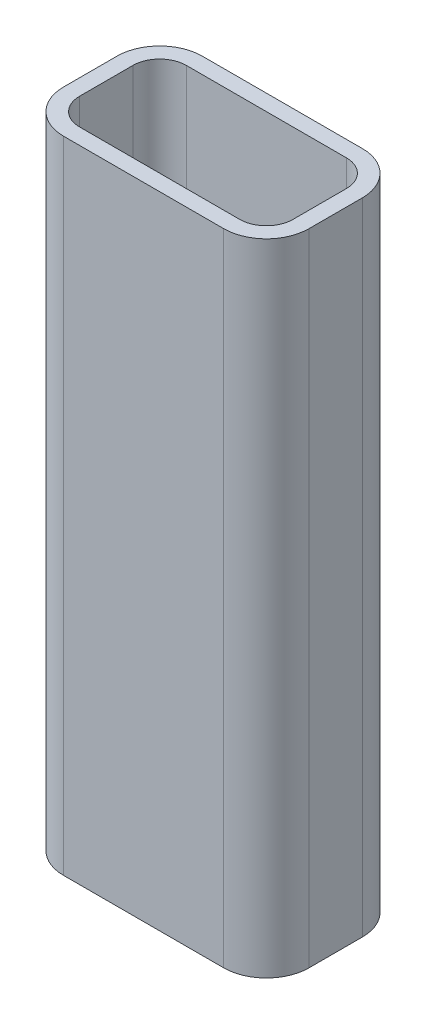
ISO-10303-21;
HEADER;
FILE_DESCRIPTION(('STEP AP214'),'2;1');
FILE_NAME('part.step','',(''),(''),'','','');
FILE_SCHEMA(('AUTOMOTIVE_DESIGN { 1 0 10303 214 1 1 1 1 }'));
ENDSEC;
DATA;
#1=APPLICATION_CONTEXT('core data for automotive mechanical design processes');
#2=APPLICATION_PROTOCOL_DEFINITION('international standard','automotive_design',2000,#1);
#3=PRODUCT_CONTEXT('',#1,'mechanical');
#4=PRODUCT('Part','Part','',(#3));
#5=PRODUCT_RELATED_PRODUCT_CATEGORY('part','',(#4));
#6=PRODUCT_DEFINITION_FORMATION('','',#4);
#7=PRODUCT_DEFINITION_CONTEXT('part definition',#1,'design');
#8=PRODUCT_DEFINITION('design','',#6,#7);
#9=PRODUCT_DEFINITION_SHAPE('','',#8);
#10=(LENGTH_UNIT() NAMED_UNIT(*) SI_UNIT(.MILLI.,.METRE.));
#11=(NAMED_UNIT(*) PLANE_ANGLE_UNIT() SI_UNIT($,.RADIAN.));
#12=(NAMED_UNIT(*) SI_UNIT($,.STERADIAN.) SOLID_ANGLE_UNIT());
#13=UNCERTAINTY_MEASURE_WITH_UNIT(LENGTH_MEASURE(1.E-05),#10,'distance_accuracy_value','');
#14=(GEOMETRIC_REPRESENTATION_CONTEXT(3) GLOBAL_UNCERTAINTY_ASSIGNED_CONTEXT((#13)) GLOBAL_UNIT_ASSIGNED_CONTEXT((#10,
#11,#12)) REPRESENTATION_CONTEXT('',''));
#15=CARTESIAN_POINT('',(0.,0.,0.));
#16=DIRECTION('',(0.,0.,1.));
#17=DIRECTION('',(1.,0.,0.));
#18=AXIS2_PLACEMENT_3D('',#15,#16,#17);
#19=CARTESIAN_POINT('',(-15.,60.,-5.));
#20=DIRECTION('',(0.,1.,0.));
#21=DIRECTION('',(0.,0.,1.));
#22=AXIS2_PLACEMENT_3D('',#19,#20,#21);
#23=PLANE('',#22);
#24=CARTESIAN_POINT('',(-15.,60.,-5.));
#25=DIRECTION('',(0.,1.,0.));
#26=DIRECTION('',(1.,0.,0.));
#27=AXIS2_PLACEMENT_3D('',#24,#25,#26);
#28=CIRCLE('',#27,8.);
#29=CARTESIAN_POINT('',(-15.,60.,-13.));
#30=VERTEX_POINT('',#29);
#31=CARTESIAN_POINT('',(-23.,60.,-5.));
#32=VERTEX_POINT('',#31);
#33=EDGE_CURVE('E260',#30,#32,#28,.T.);
#34=ORIENTED_EDGE('',*,*,#33,.T.);
#35=DIRECTION('',(0.,0.,1.));
#36=VECTOR('',#35,1.);
#37=CARTESIAN_POINT('',(-23.,60.,-5.));
#38=LINE('',#37,#36);
#39=CARTESIAN_POINT('',(-23.,60.,5.));
#40=VERTEX_POINT('',#39);
#41=EDGE_CURVE('E263',#32,#40,#38,.T.);
#42=ORIENTED_EDGE('',*,*,#41,.T.);
#43=CARTESIAN_POINT('',(-15.,60.,5.));
#44=DIRECTION('',(0.,1.,0.));
#45=DIRECTION('',(1.,0.,0.));
#46=AXIS2_PLACEMENT_3D('',#43,#44,#45);
#47=CIRCLE('',#46,8.);
#48=CARTESIAN_POINT('',(-15.,60.,13.));
#49=VERTEX_POINT('',#48);
#50=EDGE_CURVE('E266',#40,#49,#47,.T.);
#51=ORIENTED_EDGE('',*,*,#50,.T.);
#52=DIRECTION('',(1.,0.,0.));
#53=VECTOR('',#52,1.);
#54=CARTESIAN_POINT('',(-15.,60.,13.));
#55=LINE('',#54,#53);
#56=CARTESIAN_POINT('',(15.,60.,13.));
#57=VERTEX_POINT('',#56);
#58=EDGE_CURVE('E268',#49,#57,#55,.T.);
#59=ORIENTED_EDGE('',*,*,#58,.T.);
#60=CARTESIAN_POINT('',(15.,60.,5.));
#61=DIRECTION('',(0.,1.,0.));
#62=DIRECTION('',(1.,0.,0.));
#63=AXIS2_PLACEMENT_3D('',#60,#61,#62);
#64=CIRCLE('',#63,8.);
#65=CARTESIAN_POINT('',(23.,60.,5.));
#66=VERTEX_POINT('',#65);
#67=EDGE_CURVE('E270',#57,#66,#64,.T.);
#68=ORIENTED_EDGE('',*,*,#67,.T.);
#69=DIRECTION('',(0.,0.,-1.));
#70=VECTOR('',#69,1.);
#71=CARTESIAN_POINT('',(23.,60.,-5.));
#72=LINE('',#71,#70);
#73=CARTESIAN_POINT('',(23.,60.,-5.));
#74=VERTEX_POINT('',#73);
#75=EDGE_CURVE('E272',#66,#74,#72,.T.);
#76=ORIENTED_EDGE('',*,*,#75,.T.);
#77=CARTESIAN_POINT('',(15.,60.,-5.));
#78=DIRECTION('',(0.,1.,0.));
#79=DIRECTION('',(1.,0.,0.));
#80=AXIS2_PLACEMENT_3D('',#77,#78,#79);
#81=CIRCLE('',#80,8.);
#82=CARTESIAN_POINT('',(15.,60.,-13.));
#83=VERTEX_POINT('',#82);
#84=EDGE_CURVE('E274',#74,#83,#81,.T.);
#85=ORIENTED_EDGE('',*,*,#84,.T.);
#86=DIRECTION('',(-1.,0.,0.));
#87=VECTOR('',#86,1.);
#88=CARTESIAN_POINT('',(-15.,60.,-13.));
#89=LINE('',#88,#87);
#90=EDGE_CURVE('E276',#83,#30,#89,.T.);
#91=ORIENTED_EDGE('',*,*,#90,.T.);
#92=EDGE_LOOP('',(#34,#42,#51,#59,#68,#76,#85,#91));
#93=FACE_BOUND('',#92,.T.);
#94=DIRECTION('',(0.,0.,1.));
#95=VECTOR('',#94,1.);
#96=CARTESIAN_POINT('',(-20.,60.,-5.));
#97=LINE('',#96,#95);
#98=CARTESIAN_POINT('',(-20.,60.,-5.));
#99=VERTEX_POINT('',#98);
#100=CARTESIAN_POINT('',(-20.,60.,5.));
#101=VERTEX_POINT('',#100);
#102=EDGE_CURVE('E203',#99,#101,#97,.T.);
#103=ORIENTED_EDGE('',*,*,#102,.F.);
#104=CARTESIAN_POINT('',(-15.,60.,-5.));
#105=DIRECTION('',(0.,1.,0.));
#106=DIRECTION('',(0.,0.,1.));
#107=AXIS2_PLACEMENT_3D('',#104,#105,#106);
#108=CIRCLE('',#107,5.);
#109=CARTESIAN_POINT('',(-15.,60.,-10.));
#110=VERTEX_POINT('',#109);
#111=EDGE_CURVE('E195',#110,#99,#108,.T.);
#112=ORIENTED_EDGE('',*,*,#111,.F.);
#113=DIRECTION('',(-1.,0.,0.));
#114=VECTOR('',#113,1.);
#115=CARTESIAN_POINT('',(-15.,60.,-10.));
#116=LINE('',#115,#114);
#117=CARTESIAN_POINT('',(15.,60.,-10.));
#118=VERTEX_POINT('',#117);
#119=EDGE_CURVE('E228',#118,#110,#116,.T.);
#120=ORIENTED_EDGE('',*,*,#119,.F.);
#121=CARTESIAN_POINT('',(15.,60.,-5.));
#122=DIRECTION('',(0.,1.,0.));
#123=DIRECTION('',(0.,0.,-1.));
#124=AXIS2_PLACEMENT_3D('',#121,#122,#123);
#125=CIRCLE('',#124,5.);
#126=CARTESIAN_POINT('',(20.,60.,-5.));
#127=VERTEX_POINT('',#126);
#128=EDGE_CURVE('E226',#127,#118,#125,.T.);
#129=ORIENTED_EDGE('',*,*,#128,.F.);
#130=DIRECTION('',(0.,0.,-1.));
#131=VECTOR('',#130,1.);
#132=CARTESIAN_POINT('',(20.,60.,-5.));
#133=LINE('',#132,#131);
#134=CARTESIAN_POINT('',(20.,60.,5.));
#135=VERTEX_POINT('',#134);
#136=EDGE_CURVE('E224',#135,#127,#133,.T.);
#137=ORIENTED_EDGE('',*,*,#136,.F.);
#138=CARTESIAN_POINT('',(15.,60.,5.));
#139=DIRECTION('',(0.,1.,0.));
#140=DIRECTION('',(0.,0.,1.));
#141=AXIS2_PLACEMENT_3D('',#138,#139,#140);
#142=CIRCLE('',#141,5.);
#143=CARTESIAN_POINT('',(15.,60.,10.));
#144=VERTEX_POINT('',#143);
#145=EDGE_CURVE('E222',#144,#135,#142,.T.);
#146=ORIENTED_EDGE('',*,*,#145,.F.);
#147=DIRECTION('',(1.,0.,0.));
#148=VECTOR('',#147,1.);
#149=CARTESIAN_POINT('',(-15.,60.,10.));
#150=LINE('',#149,#148);
#151=CARTESIAN_POINT('',(-15.,60.,10.));
#152=VERTEX_POINT('',#151);
#153=EDGE_CURVE('E218',#152,#144,#150,.T.);
#154=ORIENTED_EDGE('',*,*,#153,.F.);
#155=CARTESIAN_POINT('',(-15.,60.,5.));
#156=DIRECTION('',(0.,1.,0.));
#157=DIRECTION('',(0.,0.,1.));
#158=AXIS2_PLACEMENT_3D('',#155,#156,#157);
#159=CIRCLE('',#158,5.);
#160=EDGE_CURVE('E216',#101,#152,#159,.T.);
#161=ORIENTED_EDGE('',*,*,#160,.F.);
#162=EDGE_LOOP('',(#103,#112,#120,#129,#137,#146,#154,#161));
#163=FACE_BOUND('',#162,.T.);
#164=ADVANCED_FACE('F82',(#93,#163),#23,.T.);
#165=CARTESIAN_POINT('',(-15.,-60.,-5.));
#166=DIRECTION('',(0.,1.,0.));
#167=DIRECTION('',(0.,0.,1.));
#168=AXIS2_PLACEMENT_3D('',#165,#166,#167);
#169=PLANE('',#168);
#170=CARTESIAN_POINT('',(-15.,-60.,-5.));
#171=DIRECTION('',(0.,1.,0.));
#172=DIRECTION('',(1.,0.,0.));
#173=AXIS2_PLACEMENT_3D('',#170,#171,#172);
#174=CIRCLE('',#173,8.);
#175=CARTESIAN_POINT('',(-15.,-60.,-13.));
#176=VERTEX_POINT('',#175);
#177=CARTESIAN_POINT('',(-23.,-60.,-5.));
#178=VERTEX_POINT('',#177);
#179=EDGE_CURVE('E211',#176,#178,#174,.T.);
#180=ORIENTED_EDGE('',*,*,#179,.F.);
#181=DIRECTION('',(-1.,0.,0.));
#182=VECTOR('',#181,1.);
#183=CARTESIAN_POINT('',(-15.,-60.,-13.));
#184=LINE('',#183,#182);
#185=CARTESIAN_POINT('',(15.,-60.,-13.));
#186=VERTEX_POINT('',#185);
#187=EDGE_CURVE('E264',#186,#176,#184,.T.);
#188=ORIENTED_EDGE('',*,*,#187,.F.);
#189=CARTESIAN_POINT('',(15.,-60.,-5.));
#190=DIRECTION('',(0.,1.,0.));
#191=DIRECTION('',(1.,0.,0.));
#192=AXIS2_PLACEMENT_3D('',#189,#190,#191);
#193=CIRCLE('',#192,8.);
#194=CARTESIAN_POINT('',(23.,-60.,-5.));
#195=VERTEX_POINT('',#194);
#196=EDGE_CURVE('E291',#195,#186,#193,.T.);
#197=ORIENTED_EDGE('',*,*,#196,.F.);
#198=DIRECTION('',(0.,0.,-1.));
#199=VECTOR('',#198,1.);
#200=CARTESIAN_POINT('',(23.,-60.,-5.));
#201=LINE('',#200,#199);
#202=CARTESIAN_POINT('',(23.,-60.,5.));
#203=VERTEX_POINT('',#202);
#204=EDGE_CURVE('E289',#203,#195,#201,.T.);
#205=ORIENTED_EDGE('',*,*,#204,.F.);
#206=CARTESIAN_POINT('',(15.,-60.,5.));
#207=DIRECTION('',(0.,1.,0.));
#208=DIRECTION('',(1.,0.,0.));
#209=AXIS2_PLACEMENT_3D('',#206,#207,#208);
#210=CIRCLE('',#209,8.);
#211=CARTESIAN_POINT('',(15.,-60.,13.));
#212=VERTEX_POINT('',#211);
#213=EDGE_CURVE('E287',#212,#203,#210,.T.);
#214=ORIENTED_EDGE('',*,*,#213,.F.);
#215=DIRECTION('',(1.,0.,0.));
#216=VECTOR('',#215,1.);
#217=CARTESIAN_POINT('',(-15.,-60.,13.));
#218=LINE('',#217,#216);
#219=CARTESIAN_POINT('',(-15.,-60.,13.));
#220=VERTEX_POINT('',#219);
#221=EDGE_CURVE('E285',#220,#212,#218,.T.);
#222=ORIENTED_EDGE('',*,*,#221,.F.);
#223=CARTESIAN_POINT('',(-15.,-60.,5.));
#224=DIRECTION('',(0.,1.,0.));
#225=DIRECTION('',(1.,0.,0.));
#226=AXIS2_PLACEMENT_3D('',#223,#224,#225);
#227=CIRCLE('',#226,8.);
#228=CARTESIAN_POINT('',(-23.,-60.,5.));
#229=VERTEX_POINT('',#228);
#230=EDGE_CURVE('E283',#229,#220,#227,.T.);
#231=ORIENTED_EDGE('',*,*,#230,.F.);
#232=DIRECTION('',(0.,0.,1.));
#233=VECTOR('',#232,1.);
#234=CARTESIAN_POINT('',(-23.,-60.,-5.));
#235=LINE('',#234,#233);
#236=EDGE_CURVE('E281',#178,#229,#235,.T.);
#237=ORIENTED_EDGE('',*,*,#236,.F.);
#238=EDGE_LOOP('',(#180,#188,#197,#205,#214,#222,#231,#237));
#239=FACE_BOUND('',#238,.T.);
#240=CARTESIAN_POINT('',(-15.,-60.,-5.));
#241=DIRECTION('',(0.,1.,0.));
#242=DIRECTION('',(0.,0.,1.));
#243=AXIS2_PLACEMENT_3D('',#240,#241,#242);
#244=CIRCLE('',#243,5.);
#245=CARTESIAN_POINT('',(-15.,-60.,-10.));
#246=VERTEX_POINT('',#245);
#247=CARTESIAN_POINT('',(-20.,-60.,-5.));
#248=VERTEX_POINT('',#247);
#249=EDGE_CURVE('E105',#246,#248,#244,.T.);
#250=ORIENTED_EDGE('',*,*,#249,.T.);
#251=DIRECTION('',(0.,0.,1.));
#252=VECTOR('',#251,1.);
#253=CARTESIAN_POINT('',(-20.,-60.,-5.));
#254=LINE('',#253,#252);
#255=CARTESIAN_POINT('',(-20.,-60.,5.));
#256=VERTEX_POINT('',#255);
#257=EDGE_CURVE('E210',#248,#256,#254,.T.);
#258=ORIENTED_EDGE('',*,*,#257,.T.);
#259=CARTESIAN_POINT('',(-15.,-60.,5.));
#260=DIRECTION('',(0.,1.,0.));
#261=DIRECTION('',(0.,0.,1.));
#262=AXIS2_PLACEMENT_3D('',#259,#260,#261);
#263=CIRCLE('',#262,5.);
#264=CARTESIAN_POINT('',(-15.,-60.,10.));
#265=VERTEX_POINT('',#264);
#266=EDGE_CURVE('E232',#256,#265,#263,.T.);
#267=ORIENTED_EDGE('',*,*,#266,.T.);
#268=DIRECTION('',(1.,0.,0.));
#269=VECTOR('',#268,1.);
#270=CARTESIAN_POINT('',(-15.,-60.,10.));
#271=LINE('',#270,#269);
#272=CARTESIAN_POINT('',(15.,-60.,10.));
#273=VERTEX_POINT('',#272);
#274=EDGE_CURVE('E235',#265,#273,#271,.T.);
#275=ORIENTED_EDGE('',*,*,#274,.T.);
#276=CARTESIAN_POINT('',(15.,-60.,5.));
#277=DIRECTION('',(0.,1.,0.));
#278=DIRECTION('',(0.,0.,1.));
#279=AXIS2_PLACEMENT_3D('',#276,#277,#278);
#280=CIRCLE('',#279,5.);
#281=CARTESIAN_POINT('',(20.,-60.,5.));
#282=VERTEX_POINT('',#281);
#283=EDGE_CURVE('E238',#273,#282,#280,.T.);
#284=ORIENTED_EDGE('',*,*,#283,.T.);
#285=DIRECTION('',(0.,0.,-1.));
#286=VECTOR('',#285,1.);
#287=CARTESIAN_POINT('',(20.,-60.,-5.));
#288=LINE('',#287,#286);
#289=CARTESIAN_POINT('',(20.,-60.,-5.));
#290=VERTEX_POINT('',#289);
#291=EDGE_CURVE('E241',#282,#290,#288,.T.);
#292=ORIENTED_EDGE('',*,*,#291,.T.);
#293=CARTESIAN_POINT('',(15.,-60.,-5.));
#294=DIRECTION('',(0.,1.,0.));
#295=DIRECTION('',(0.,0.,-1.));
#296=AXIS2_PLACEMENT_3D('',#293,#294,#295);
#297=CIRCLE('',#296,5.);
#298=CARTESIAN_POINT('',(15.,-60.,-10.));
#299=VERTEX_POINT('',#298);
#300=EDGE_CURVE('E244',#290,#299,#297,.T.);
#301=ORIENTED_EDGE('',*,*,#300,.T.);
#302=DIRECTION('',(-1.,0.,0.));
#303=VECTOR('',#302,1.);
#304=CARTESIAN_POINT('',(-15.,-60.,-10.));
#305=LINE('',#304,#303);
#306=EDGE_CURVE('E204',#299,#246,#305,.T.);
#307=ORIENTED_EDGE('',*,*,#306,.T.);
#308=EDGE_LOOP('',(#250,#258,#267,#275,#284,#292,#301,#307));
#309=FACE_BOUND('',#308,.T.);
#310=ADVANCED_FACE('F321',(#239,#309),#169,.F.);
#311=CARTESIAN_POINT('',(-15.,60.,-5.));
#312=DIRECTION('',(0.,-1.,0.));
#313=DIRECTION('',(0.,0.,-1.));
#314=AXIS2_PLACEMENT_3D('',#311,#312,#313);
#315=CYLINDRICAL_SURFACE('',#314,8.);
#316=ORIENTED_EDGE('',*,*,#179,.T.);
#317=DIRECTION('',(0.,-1.,0.));
#318=VECTOR('',#317,1.);
#319=CARTESIAN_POINT('',(-23.,60.,-5.));
#320=LINE('',#319,#318);
#321=EDGE_CURVE('E12',#32,#178,#320,.T.);
#322=ORIENTED_EDGE('',*,*,#321,.F.);
#323=ORIENTED_EDGE('',*,*,#33,.F.);
#324=DIRECTION('',(0.,-1.,0.));
#325=VECTOR('',#324,1.);
#326=CARTESIAN_POINT('',(-15.,60.,-13.));
#327=LINE('',#326,#325);
#328=EDGE_CURVE('E278',#30,#176,#327,.T.);
#329=ORIENTED_EDGE('',*,*,#328,.T.);
#330=EDGE_LOOP('',(#316,#322,#323,#329));
#331=FACE_BOUND('',#330,.T.);
#332=ADVANCED_FACE('F84',(#331),#315,.T.);
#333=CARTESIAN_POINT('',(-23.,60.,-5.));
#334=DIRECTION('',(1.,0.,0.));
#335=DIRECTION('',(0.,0.,-1.));
#336=AXIS2_PLACEMENT_3D('',#333,#334,#335);
#337=PLANE('',#336);
#338=ORIENTED_EDGE('',*,*,#236,.T.);
#339=DIRECTION('',(0.,-1.,0.));
#340=VECTOR('',#339,1.);
#341=CARTESIAN_POINT('',(-23.,60.,5.));
#342=LINE('',#341,#340);
#343=EDGE_CURVE('E90',#40,#229,#342,.T.);
#344=ORIENTED_EDGE('',*,*,#343,.F.);
#345=ORIENTED_EDGE('',*,*,#41,.F.);
#346=ORIENTED_EDGE('',*,*,#321,.T.);
#347=EDGE_LOOP('',(#338,#344,#345,#346));
#348=FACE_BOUND('',#347,.T.);
#349=ADVANCED_FACE('F338',(#348),#337,.F.);
#350=CARTESIAN_POINT('',(-15.,60.,5.));
#351=DIRECTION('',(0.,-1.,0.));
#352=DIRECTION('',(0.,0.,-1.));
#353=AXIS2_PLACEMENT_3D('',#350,#351,#352);
#354=CYLINDRICAL_SURFACE('',#353,8.);
#355=ORIENTED_EDGE('',*,*,#230,.T.);
#356=DIRECTION('',(0.,-1.,0.));
#357=VECTOR('',#356,1.);
#358=CARTESIAN_POINT('',(-15.,60.,13.));
#359=LINE('',#358,#357);
#360=EDGE_CURVE('E308',#49,#220,#359,.T.);
#361=ORIENTED_EDGE('',*,*,#360,.F.);
#362=ORIENTED_EDGE('',*,*,#50,.F.);
#363=ORIENTED_EDGE('',*,*,#343,.T.);
#364=EDGE_LOOP('',(#355,#361,#362,#363));
#365=FACE_BOUND('',#364,.T.);
#366=ADVANCED_FACE('F315',(#365),#354,.T.);
#367=CARTESIAN_POINT('',(-15.,60.,13.));
#368=DIRECTION('',(0.,0.,-1.));
#369=DIRECTION('',(-1.,0.,0.));
#370=AXIS2_PLACEMENT_3D('',#367,#368,#369);
#371=PLANE('',#370);
#372=ORIENTED_EDGE('',*,*,#221,.T.);
#373=DIRECTION('',(0.,-1.,0.));
#374=VECTOR('',#373,1.);
#375=CARTESIAN_POINT('',(15.,60.,13.));
#376=LINE('',#375,#374);
#377=EDGE_CURVE('E305',#57,#212,#376,.T.);
#378=ORIENTED_EDGE('',*,*,#377,.F.);
#379=ORIENTED_EDGE('',*,*,#58,.F.);
#380=ORIENTED_EDGE('',*,*,#360,.T.);
#381=EDGE_LOOP('',(#372,#378,#379,#380));
#382=FACE_BOUND('',#381,.T.);
#383=ADVANCED_FACE('F327',(#382),#371,.F.);
#384=CARTESIAN_POINT('',(15.,60.,5.));
#385=DIRECTION('',(0.,-1.,0.));
#386=DIRECTION('',(0.,0.,-1.));
#387=AXIS2_PLACEMENT_3D('',#384,#385,#386);
#388=CYLINDRICAL_SURFACE('',#387,8.);
#389=ORIENTED_EDGE('',*,*,#213,.T.);
#390=DIRECTION('',(0.,-1.,0.));
#391=VECTOR('',#390,1.);
#392=CARTESIAN_POINT('',(23.,60.,5.));
#393=LINE('',#392,#391);
#394=EDGE_CURVE('E302',#66,#203,#393,.T.);
#395=ORIENTED_EDGE('',*,*,#394,.F.);
#396=ORIENTED_EDGE('',*,*,#67,.F.);
#397=ORIENTED_EDGE('',*,*,#377,.T.);
#398=EDGE_LOOP('',(#389,#395,#396,#397));
#399=FACE_BOUND('',#398,.T.);
#400=ADVANCED_FACE('F331',(#399),#388,.T.);
#401=CARTESIAN_POINT('',(23.,60.,-5.));
#402=DIRECTION('',(-1.,0.,0.));
#403=DIRECTION('',(0.,0.,1.));
#404=AXIS2_PLACEMENT_3D('',#401,#402,#403);
#405=PLANE('',#404);
#406=ORIENTED_EDGE('',*,*,#204,.T.);
#407=DIRECTION('',(0.,-1.,0.));
#408=VECTOR('',#407,1.);
#409=CARTESIAN_POINT('',(23.,60.,-5.));
#410=LINE('',#409,#408);
#411=EDGE_CURVE('E299',#74,#195,#410,.T.);
#412=ORIENTED_EDGE('',*,*,#411,.F.);
#413=ORIENTED_EDGE('',*,*,#75,.F.);
#414=ORIENTED_EDGE('',*,*,#394,.T.);
#415=EDGE_LOOP('',(#406,#412,#413,#414));
#416=FACE_BOUND('',#415,.T.);
#417=ADVANCED_FACE('F351',(#416),#405,.F.);
#418=CARTESIAN_POINT('',(15.,60.,-5.));
#419=DIRECTION('',(0.,-1.,0.));
#420=DIRECTION('',(0.,0.,-1.));
#421=AXIS2_PLACEMENT_3D('',#418,#419,#420);
#422=CYLINDRICAL_SURFACE('',#421,8.);
#423=ORIENTED_EDGE('',*,*,#196,.T.);
#424=DIRECTION('',(0.,-1.,0.));
#425=VECTOR('',#424,1.);
#426=CARTESIAN_POINT('',(15.,60.,-13.));
#427=LINE('',#426,#425);
#428=EDGE_CURVE('E296',#83,#186,#427,.T.);
#429=ORIENTED_EDGE('',*,*,#428,.F.);
#430=ORIENTED_EDGE('',*,*,#84,.F.);
#431=ORIENTED_EDGE('',*,*,#411,.T.);
#432=EDGE_LOOP('',(#423,#429,#430,#431));
#433=FACE_BOUND('',#432,.T.);
#434=ADVANCED_FACE('F349',(#433),#422,.T.);
#435=CARTESIAN_POINT('',(-15.,60.,-13.));
#436=DIRECTION('',(0.,0.,1.));
#437=DIRECTION('',(1.,0.,0.));
#438=AXIS2_PLACEMENT_3D('',#435,#436,#437);
#439=PLANE('',#438);
#440=ORIENTED_EDGE('',*,*,#187,.T.);
#441=ORIENTED_EDGE('',*,*,#328,.F.);
#442=ORIENTED_EDGE('',*,*,#90,.F.);
#443=ORIENTED_EDGE('',*,*,#428,.T.);
#444=EDGE_LOOP('',(#440,#441,#442,#443));
#445=FACE_BOUND('',#444,.T.);
#446=ADVANCED_FACE('F344',(#445),#439,.F.);
#447=CARTESIAN_POINT('',(-15.,60.,-5.));
#448=DIRECTION('',(0.,-1.,0.));
#449=DIRECTION('',(0.,0.,-1.));
#450=AXIS2_PLACEMENT_3D('',#447,#448,#449);
#451=CYLINDRICAL_SURFACE('',#450,5.);
#452=ORIENTED_EDGE('',*,*,#249,.F.);
#453=DIRECTION('',(0.,-1.,0.));
#454=VECTOR('',#453,1.);
#455=CARTESIAN_POINT('',(-15.,60.,-10.));
#456=LINE('',#455,#454);
#457=EDGE_CURVE('E199',#110,#246,#456,.T.);
#458=ORIENTED_EDGE('',*,*,#457,.F.);
#459=ORIENTED_EDGE('',*,*,#111,.T.);
#460=DIRECTION('',(0.,-1.,0.));
#461=VECTOR('',#460,1.);
#462=CARTESIAN_POINT('',(-20.,60.,-5.));
#463=LINE('',#462,#461);
#464=EDGE_CURVE('E198',#99,#248,#463,.T.);
#465=ORIENTED_EDGE('',*,*,#464,.T.);
#466=EDGE_LOOP('',(#452,#458,#459,#465));
#467=FACE_BOUND('',#466,.T.);
#468=ADVANCED_FACE('F197',(#467),#451,.F.);
#469=CARTESIAN_POINT('',(-20.,60.,-5.));
#470=DIRECTION('',(1.,0.,0.));
#471=DIRECTION('',(0.,0.,-1.));
#472=AXIS2_PLACEMENT_3D('',#469,#470,#471);
#473=PLANE('',#472);
#474=ORIENTED_EDGE('',*,*,#257,.F.);
#475=ORIENTED_EDGE('',*,*,#464,.F.);
#476=ORIENTED_EDGE('',*,*,#102,.T.);
#477=DIRECTION('',(0.,-1.,0.));
#478=VECTOR('',#477,1.);
#479=CARTESIAN_POINT('',(-20.,60.,5.));
#480=LINE('',#479,#478);
#481=EDGE_CURVE('E212',#101,#256,#480,.T.);
#482=ORIENTED_EDGE('',*,*,#481,.T.);
#483=EDGE_LOOP('',(#474,#475,#476,#482));
#484=FACE_BOUND('',#483,.T.);
#485=ADVANCED_FACE('F207',(#484),#473,.T.);
#486=CARTESIAN_POINT('',(-15.,60.,5.));
#487=DIRECTION('',(0.,-1.,0.));
#488=DIRECTION('',(0.,0.,-1.));
#489=AXIS2_PLACEMENT_3D('',#486,#487,#488);
#490=CYLINDRICAL_SURFACE('',#489,5.);
#491=ORIENTED_EDGE('',*,*,#266,.F.);
#492=ORIENTED_EDGE('',*,*,#481,.F.);
#493=ORIENTED_EDGE('',*,*,#160,.T.);
#494=DIRECTION('',(0.,-1.,0.));
#495=VECTOR('',#494,1.);
#496=CARTESIAN_POINT('',(-15.,60.,10.));
#497=LINE('',#496,#495);
#498=EDGE_CURVE('E257',#152,#265,#497,.T.);
#499=ORIENTED_EDGE('',*,*,#498,.T.);
#500=EDGE_LOOP('',(#491,#492,#493,#499));
#501=FACE_BOUND('',#500,.T.);
#502=ADVANCED_FACE('F376',(#501),#490,.F.);
#503=CARTESIAN_POINT('',(-15.,60.,10.));
#504=DIRECTION('',(0.,0.,-1.));
#505=DIRECTION('',(-1.,0.,0.));
#506=AXIS2_PLACEMENT_3D('',#503,#504,#505);
#507=PLANE('',#506);
#508=ORIENTED_EDGE('',*,*,#274,.F.);
#509=ORIENTED_EDGE('',*,*,#498,.F.);
#510=ORIENTED_EDGE('',*,*,#153,.T.);
#511=DIRECTION('',(0.,-1.,0.));
#512=VECTOR('',#511,1.);
#513=CARTESIAN_POINT('',(15.,60.,10.));
#514=LINE('',#513,#512);
#515=EDGE_CURVE('E255',#144,#273,#514,.T.);
#516=ORIENTED_EDGE('',*,*,#515,.T.);
#517=EDGE_LOOP('',(#508,#509,#510,#516));
#518=FACE_BOUND('',#517,.T.);
#519=ADVANCED_FACE('F380',(#518),#507,.T.);
#520=CARTESIAN_POINT('',(15.,60.,5.));
#521=DIRECTION('',(0.,-1.,0.));
#522=DIRECTION('',(0.,0.,-1.));
#523=AXIS2_PLACEMENT_3D('',#520,#521,#522);
#524=CYLINDRICAL_SURFACE('',#523,5.);
#525=ORIENTED_EDGE('',*,*,#283,.F.);
#526=ORIENTED_EDGE('',*,*,#515,.F.);
#527=ORIENTED_EDGE('',*,*,#145,.T.);
#528=DIRECTION('',(0.,-1.,0.));
#529=VECTOR('',#528,1.);
#530=CARTESIAN_POINT('',(20.,60.,5.));
#531=LINE('',#530,#529);
#532=EDGE_CURVE('E253',#135,#282,#531,.T.);
#533=ORIENTED_EDGE('',*,*,#532,.T.);
#534=EDGE_LOOP('',(#525,#526,#527,#533));
#535=FACE_BOUND('',#534,.T.);
#536=ADVANCED_FACE('F386',(#535),#524,.F.);
#537=CARTESIAN_POINT('',(20.,60.,-5.));
#538=DIRECTION('',(-1.,0.,0.));
#539=DIRECTION('',(0.,0.,1.));
#540=AXIS2_PLACEMENT_3D('',#537,#538,#539);
#541=PLANE('',#540);
#542=ORIENTED_EDGE('',*,*,#291,.F.);
#543=ORIENTED_EDGE('',*,*,#532,.F.);
#544=ORIENTED_EDGE('',*,*,#136,.T.);
#545=DIRECTION('',(0.,-1.,0.));
#546=VECTOR('',#545,1.);
#547=CARTESIAN_POINT('',(20.,60.,-5.));
#548=LINE('',#547,#546);
#549=EDGE_CURVE('E251',#127,#290,#548,.T.);
#550=ORIENTED_EDGE('',*,*,#549,.T.);
#551=EDGE_LOOP('',(#542,#543,#544,#550));
#552=FACE_BOUND('',#551,.T.);
#553=ADVANCED_FACE('F390',(#552),#541,.T.);
#554=CARTESIAN_POINT('',(15.,60.,-5.));
#555=DIRECTION('',(0.,-1.,0.));
#556=DIRECTION('',(0.,0.,-1.));
#557=AXIS2_PLACEMENT_3D('',#554,#555,#556);
#558=CYLINDRICAL_SURFACE('',#557,5.);
#559=ORIENTED_EDGE('',*,*,#300,.F.);
#560=ORIENTED_EDGE('',*,*,#549,.F.);
#561=ORIENTED_EDGE('',*,*,#128,.T.);
#562=DIRECTION('',(0.,-1.,0.));
#563=VECTOR('',#562,1.);
#564=CARTESIAN_POINT('',(15.,60.,-10.));
#565=LINE('',#564,#563);
#566=EDGE_CURVE('E97',#118,#299,#565,.T.);
#567=ORIENTED_EDGE('',*,*,#566,.T.);
#568=EDGE_LOOP('',(#559,#560,#561,#567));
#569=FACE_BOUND('',#568,.T.);
#570=ADVANCED_FACE('F394',(#569),#558,.F.);
#571=CARTESIAN_POINT('',(-15.,60.,-10.));
#572=DIRECTION('',(0.,0.,1.));
#573=DIRECTION('',(1.,0.,0.));
#574=AXIS2_PLACEMENT_3D('',#571,#572,#573);
#575=PLANE('',#574);
#576=ORIENTED_EDGE('',*,*,#306,.F.);
#577=ORIENTED_EDGE('',*,*,#566,.F.);
#578=ORIENTED_EDGE('',*,*,#119,.T.);
#579=ORIENTED_EDGE('',*,*,#457,.T.);
#580=EDGE_LOOP('',(#576,#577,#578,#579));
#581=FACE_BOUND('',#580,.T.);
#582=ADVANCED_FACE('F398',(#581),#575,.T.);
#583=CLOSED_SHELL('',(#164,#310,#332,#349,#366,#383,#400,#417,#434,#446,#468,#485,#502,#519,
#536,#553,#570,#582));
#584=MANIFOLD_SOLID_BREP('B2',#583);
#585=ADVANCED_BREP_SHAPE_REPRESENTATION('',(#18,#584),#14);
#586=SHAPE_DEFINITION_REPRESENTATION(#9,#585);
ENDSEC;
END-ISO-10303-21;
